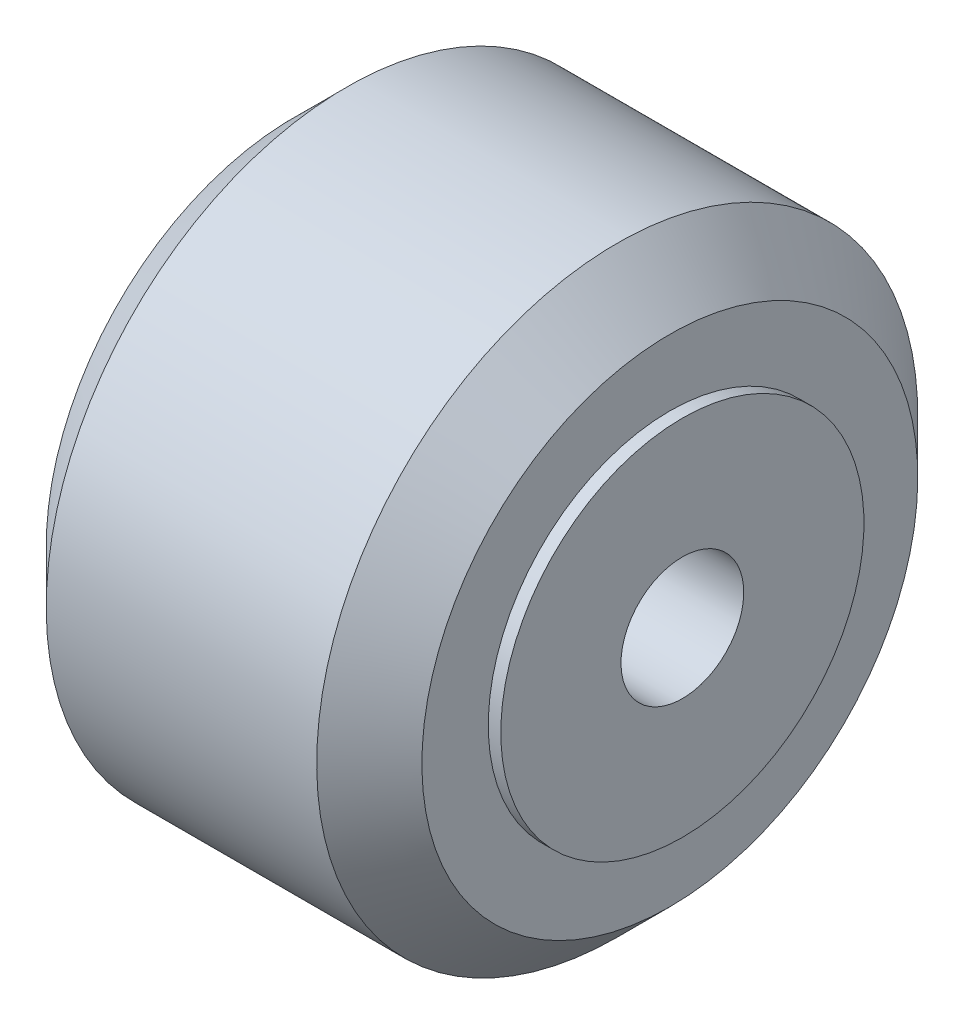
ISO-10303-21;
HEADER;
FILE_DESCRIPTION(('STEP AP214'),'2;1');
FILE_NAME('part.step','',(''),(''),'','','');
FILE_SCHEMA(('AUTOMOTIVE_DESIGN { 1 0 10303 214 1 1 1 1 }'));
ENDSEC;
DATA;
#1=APPLICATION_CONTEXT('core data for automotive mechanical design processes');
#2=APPLICATION_PROTOCOL_DEFINITION('international standard','automotive_design',2000,#1);
#3=PRODUCT_CONTEXT('',#1,'mechanical');
#4=PRODUCT('Part','Part','',(#3));
#5=PRODUCT_RELATED_PRODUCT_CATEGORY('part','',(#4));
#6=PRODUCT_DEFINITION_FORMATION('','',#4);
#7=PRODUCT_DEFINITION_CONTEXT('part definition',#1,'design');
#8=PRODUCT_DEFINITION('design','',#6,#7);
#9=PRODUCT_DEFINITION_SHAPE('','',#8);
#10=(LENGTH_UNIT() NAMED_UNIT(*) SI_UNIT(.MILLI.,.METRE.));
#11=(NAMED_UNIT(*) PLANE_ANGLE_UNIT() SI_UNIT($,.RADIAN.));
#12=(NAMED_UNIT(*) SI_UNIT($,.STERADIAN.) SOLID_ANGLE_UNIT());
#13=UNCERTAINTY_MEASURE_WITH_UNIT(LENGTH_MEASURE(1.E-05),#10,'distance_accuracy_value','');
#14=(GEOMETRIC_REPRESENTATION_CONTEXT(3) GLOBAL_UNCERTAINTY_ASSIGNED_CONTEXT((#13)) GLOBAL_UNIT_ASSIGNED_CONTEXT((#10,
#11,#12)) REPRESENTATION_CONTEXT('',''));
#15=CARTESIAN_POINT('',(0.,0.,0.));
#16=DIRECTION('',(0.,0.,1.));
#17=DIRECTION('',(1.,0.,0.));
#18=AXIS2_PLACEMENT_3D('',#15,#16,#17);
#19=CARTESIAN_POINT('',(-8.1,0.,0.));
#20=DIRECTION('',(1.,0.,0.));
#21=DIRECTION('',(0.,1.,0.));
#22=AXIS2_PLACEMENT_3D('',#19,#20,#21);
#23=CYLINDRICAL_SURFACE('',#22,7.25);
#24=CARTESIAN_POINT('',(-8.1,0.,0.));
#25=DIRECTION('',(1.,0.,0.));
#26=DIRECTION('',(0.,1.,0.));
#27=AXIS2_PLACEMENT_3D('',#24,#25,#26);
#28=CIRCLE('',#27,7.25);
#29=CARTESIAN_POINT('',(-8.1,7.25,0.));
#30=VERTEX_POINT('',#29);
#31=EDGE_CURVE('E12',#30,#30,#28,.T.);
#32=ORIENTED_EDGE('',*,*,#31,.T.);
#33=EDGE_LOOP('',(#32));
#34=FACE_BOUND('',#33,.T.);
#35=CARTESIAN_POINT('',(8.,0.,0.));
#36=DIRECTION('',(1.,0.,0.));
#37=DIRECTION('',(0.,1.,0.));
#38=AXIS2_PLACEMENT_3D('',#35,#36,#37);
#39=CIRCLE('',#38,7.25);
#40=CARTESIAN_POINT('',(8.,7.25,0.));
#41=VERTEX_POINT('',#40);
#42=EDGE_CURVE('E71',#41,#41,#39,.T.);
#43=ORIENTED_EDGE('',*,*,#42,.F.);
#44=EDGE_LOOP('',(#43));
#45=FACE_BOUND('',#44,.T.);
#46=ADVANCED_FACE('F61',(#34,#45),#23,.T.);
#47=CARTESIAN_POINT('',(-8.1,0.,0.));
#48=DIRECTION('',(1.,0.,0.));
#49=DIRECTION('',(0.,1.,0.));
#50=AXIS2_PLACEMENT_3D('',#47,#48,#49);
#51=PLANE('',#50);
#52=CARTESIAN_POINT('',(-8.1,0.,0.));
#53=DIRECTION('',(1.,0.,0.));
#54=DIRECTION('',(0.,1.,0.));
#55=AXIS2_PLACEMENT_3D('',#52,#53,#54);
#56=CIRCLE('',#55,2.45);
#57=CARTESIAN_POINT('',(-8.1,2.45,0.));
#58=VERTEX_POINT('',#57);
#59=EDGE_CURVE('E67',#58,#58,#56,.T.);
#60=ORIENTED_EDGE('',*,*,#59,.T.);
#61=EDGE_LOOP('',(#60));
#62=FACE_BOUND('',#61,.T.);
#63=ORIENTED_EDGE('',*,*,#31,.F.);
#64=EDGE_LOOP('',(#63));
#65=FACE_BOUND('',#64,.T.);
#66=ADVANCED_FACE('F90',(#62,#65),#51,.F.);
#67=CARTESIAN_POINT('',(-8.1,0.,0.));
#68=DIRECTION('',(1.,0.,0.));
#69=DIRECTION('',(0.,1.,0.));
#70=AXIS2_PLACEMENT_3D('',#67,#68,#69);
#71=CYLINDRICAL_SURFACE('',#70,2.45);
#72=ORIENTED_EDGE('',*,*,#59,.F.);
#73=EDGE_LOOP('',(#72));
#74=FACE_BOUND('',#73,.T.);
#75=CARTESIAN_POINT('',(8.,0.,0.));
#76=DIRECTION('',(1.,0.,0.));
#77=DIRECTION('',(0.,1.,0.));
#78=AXIS2_PLACEMENT_3D('',#75,#76,#77);
#79=CIRCLE('',#78,2.45);
#80=CARTESIAN_POINT('',(8.,2.45,0.));
#81=VERTEX_POINT('',#80);
#82=EDGE_CURVE('E75',#81,#81,#79,.T.);
#83=ORIENTED_EDGE('',*,*,#82,.T.);
#84=EDGE_LOOP('',(#83));
#85=FACE_BOUND('',#84,.T.);
#86=ADVANCED_FACE('F81',(#74,#85),#71,.F.);
#87=CARTESIAN_POINT('',(8.,0.,0.));
#88=DIRECTION('',(1.,0.,0.));
#89=DIRECTION('',(0.,1.,0.));
#90=AXIS2_PLACEMENT_3D('',#87,#88,#89);
#91=PLANE('',#90);
#92=ORIENTED_EDGE('',*,*,#42,.T.);
#93=EDGE_LOOP('',(#92));
#94=FACE_BOUND('',#93,.T.);
#95=ORIENTED_EDGE('',*,*,#82,.F.);
#96=EDGE_LOOP('',(#95));
#97=FACE_BOUND('',#96,.T.);
#98=ADVANCED_FACE('F83',(#94,#97),#91,.T.);
#99=CLOSED_SHELL('',(#46,#66,#86,#98));
#100=MANIFOLD_SOLID_BREP('B2',#99);
#101=CARTESIAN_POINT('',(5.4,0.,0.));
#102=DIRECTION('',(-1.,0.,0.));
#103=DIRECTION('',(0.,-1.,0.));
#104=AXIS2_PLACEMENT_3D('',#101,#102,#103);
#105=CONICAL_SURFACE('',#104,12.,0.785398163397454);
#106=CARTESIAN_POINT('',(7.5,0.,0.));
#107=DIRECTION('',(-1.,0.,0.));
#108=DIRECTION('',(0.,-1.,0.));
#109=AXIS2_PLACEMENT_3D('',#106,#107,#108);
#110=CIRCLE('',#109,9.89999999999998);
#111=CARTESIAN_POINT('',(7.5,-9.89999999999998,0.));
#112=VERTEX_POINT('',#111);
#113=EDGE_CURVE('E142',#112,#112,#110,.T.);
#114=ORIENTED_EDGE('',*,*,#113,.T.);
#115=EDGE_LOOP('',(#114));
#116=FACE_BOUND('',#115,.T.);
#117=CARTESIAN_POINT('',(5.4,0.,0.));
#118=DIRECTION('',(-1.,0.,0.));
#119=DIRECTION('',(0.,-1.,0.));
#120=AXIS2_PLACEMENT_3D('',#117,#118,#119);
#121=CIRCLE('',#120,12.);
#122=CARTESIAN_POINT('',(5.4,-12.,0.));
#123=VERTEX_POINT('',#122);
#124=EDGE_CURVE('E60',#123,#123,#121,.T.);
#125=ORIENTED_EDGE('',*,*,#124,.F.);
#126=EDGE_LOOP('',(#125));
#127=FACE_BOUND('',#126,.T.);
#128=ADVANCED_FACE('F123',(#116,#127),#105,.T.);
#129=CARTESIAN_POINT('',(0.,0.,0.));
#130=DIRECTION('',(-1.,0.,0.));
#131=DIRECTION('',(0.,-1.,0.));
#132=AXIS2_PLACEMENT_3D('',#129,#130,#131);
#133=CYLINDRICAL_SURFACE('',#132,12.);
#134=ORIENTED_EDGE('',*,*,#124,.T.);
#135=EDGE_LOOP('',(#134));
#136=FACE_BOUND('',#135,.T.);
#137=CARTESIAN_POINT('',(-5.4,0.,0.));
#138=DIRECTION('',(-1.,0.,0.));
#139=DIRECTION('',(0.,-1.,0.));
#140=AXIS2_PLACEMENT_3D('',#137,#138,#139);
#141=CIRCLE('',#140,12.);
#142=CARTESIAN_POINT('',(-5.4,-12.,0.));
#143=VERTEX_POINT('',#142);
#144=EDGE_CURVE('E131',#143,#143,#141,.T.);
#145=ORIENTED_EDGE('',*,*,#144,.F.);
#146=EDGE_LOOP('',(#145));
#147=FACE_BOUND('',#146,.T.);
#148=ADVANCED_FACE('F166',(#136,#147),#133,.T.);
#149=CARTESIAN_POINT('',(-5.4,0.,0.));
#150=DIRECTION('',(1.,0.,0.));
#151=DIRECTION('',(0.,1.,0.));
#152=AXIS2_PLACEMENT_3D('',#149,#150,#151);
#153=CONICAL_SURFACE('',#152,12.,0.785398163397454);
#154=CARTESIAN_POINT('',(-7.5,0.,0.));
#155=DIRECTION('',(-1.,0.,0.));
#156=DIRECTION('',(0.,-1.,0.));
#157=AXIS2_PLACEMENT_3D('',#154,#155,#156);
#158=CIRCLE('',#157,9.89999999999998);
#159=CARTESIAN_POINT('',(-7.5,-9.89999999999998,0.));
#160=VERTEX_POINT('',#159);
#161=EDGE_CURVE('E136',#160,#160,#158,.T.);
#162=ORIENTED_EDGE('',*,*,#161,.F.);
#163=EDGE_LOOP('',(#162));
#164=FACE_BOUND('',#163,.T.);
#165=ORIENTED_EDGE('',*,*,#144,.T.);
#166=EDGE_LOOP('',(#165));
#167=FACE_BOUND('',#166,.T.);
#168=ADVANCED_FACE('F170',(#164,#167),#153,.T.);
#169=CARTESIAN_POINT('',(-7.5,0.,0.));
#170=DIRECTION('',(-1.,0.,0.));
#171=DIRECTION('',(0.,-1.,0.));
#172=AXIS2_PLACEMENT_3D('',#169,#170,#171);
#173=PLANE('',#172);
#174=CARTESIAN_POINT('',(-7.5,0.,0.));
#175=DIRECTION('',(-1.,0.,0.));
#176=DIRECTION('',(0.,-1.,0.));
#177=AXIS2_PLACEMENT_3D('',#174,#175,#176);
#178=CIRCLE('',#177,7.25);
#179=CARTESIAN_POINT('',(-7.5,-7.25,0.));
#180=VERTEX_POINT('',#179);
#181=EDGE_CURVE('E146',#180,#180,#178,.F.);
#182=ORIENTED_EDGE('',*,*,#181,.T.);
#183=EDGE_LOOP('',(#182));
#184=FACE_BOUND('',#183,.T.);
#185=ORIENTED_EDGE('',*,*,#161,.T.);
#186=EDGE_LOOP('',(#185));
#187=FACE_BOUND('',#186,.T.);
#188=ADVANCED_FACE('F160',(#184,#187),#173,.T.);
#189=CARTESIAN_POINT('',(7.5,0.,0.));
#190=DIRECTION('',(-1.,0.,0.));
#191=DIRECTION('',(0.,-1.,0.));
#192=AXIS2_PLACEMENT_3D('',#189,#190,#191);
#193=PLANE('',#192);
#194=CARTESIAN_POINT('',(7.5,0.,0.));
#195=DIRECTION('',(-1.,0.,0.));
#196=DIRECTION('',(0.,-1.,0.));
#197=AXIS2_PLACEMENT_3D('',#194,#195,#196);
#198=CIRCLE('',#197,7.25);
#199=CARTESIAN_POINT('',(7.5,-7.25,0.));
#200=VERTEX_POINT('',#199);
#201=EDGE_CURVE('E126',#200,#200,#198,.F.);
#202=ORIENTED_EDGE('',*,*,#201,.F.);
#203=EDGE_LOOP('',(#202));
#204=FACE_BOUND('',#203,.T.);
#205=ORIENTED_EDGE('',*,*,#113,.F.);
#206=EDGE_LOOP('',(#205));
#207=FACE_BOUND('',#206,.T.);
#208=ADVANCED_FACE('F157',(#204,#207),#193,.F.);
#209=CARTESIAN_POINT('',(21.5,0.,0.));
#210=DIRECTION('',(-1.,0.,0.));
#211=DIRECTION('',(0.,-1.,0.));
#212=AXIS2_PLACEMENT_3D('',#209,#210,#211);
#213=CYLINDRICAL_SURFACE('',#212,7.25);
#214=ORIENTED_EDGE('',*,*,#181,.F.);
#215=EDGE_LOOP('',(#214));
#216=FACE_BOUND('',#215,.T.);
#217=ORIENTED_EDGE('',*,*,#201,.T.);
#218=EDGE_LOOP('',(#217));
#219=FACE_BOUND('',#218,.T.);
#220=ADVANCED_FACE('F155',(#216,#219),#213,.F.);
#221=CLOSED_SHELL('',(#128,#148,#168,#188,#208,#220));
#222=MANIFOLD_SOLID_BREP('B7',#221);
#223=ADVANCED_BREP_SHAPE_REPRESENTATION('',(#18,#100,#222),#14);
#224=SHAPE_DEFINITION_REPRESENTATION(#9,#223);
ENDSEC;
END-ISO-10303-21;
